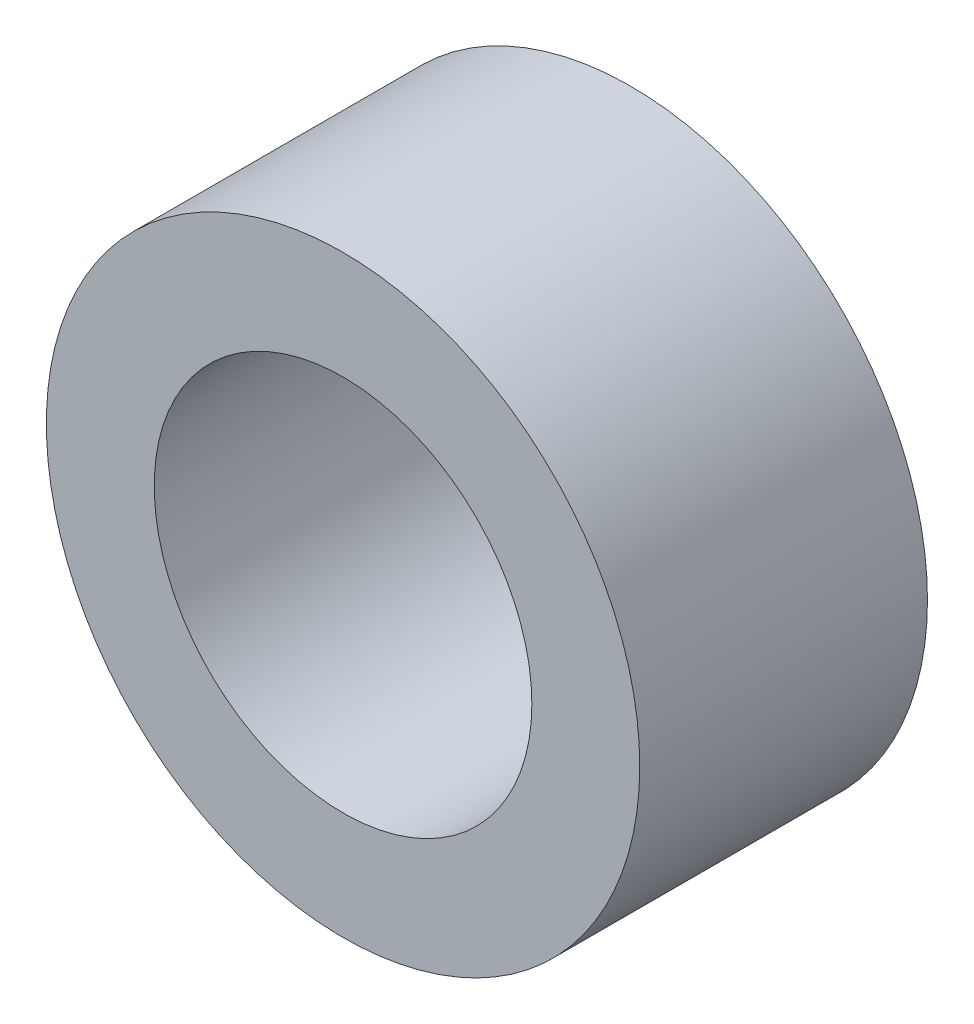
ISO-10303-21;
HEADER;
FILE_DESCRIPTION(('STEP AP214'),'2;1');
FILE_NAME('part.step','',(''),(''),'','','');
FILE_SCHEMA(('AUTOMOTIVE_DESIGN { 1 0 10303 214 1 1 1 1 }'));
ENDSEC;
DATA;
#1=APPLICATION_CONTEXT('core data for automotive mechanical design processes');
#2=APPLICATION_PROTOCOL_DEFINITION('international standard','automotive_design',2000,#1);
#3=PRODUCT_CONTEXT('',#1,'mechanical');
#4=PRODUCT('Part','Part','',(#3));
#5=PRODUCT_RELATED_PRODUCT_CATEGORY('part','',(#4));
#6=PRODUCT_DEFINITION_FORMATION('','',#4);
#7=PRODUCT_DEFINITION_CONTEXT('part definition',#1,'design');
#8=PRODUCT_DEFINITION('design','',#6,#7);
#9=PRODUCT_DEFINITION_SHAPE('','',#8);
#10=(LENGTH_UNIT() NAMED_UNIT(*) SI_UNIT(.MILLI.,.METRE.));
#11=(NAMED_UNIT(*) PLANE_ANGLE_UNIT() SI_UNIT($,.RADIAN.));
#12=(NAMED_UNIT(*) SI_UNIT($,.STERADIAN.) SOLID_ANGLE_UNIT());
#13=UNCERTAINTY_MEASURE_WITH_UNIT(LENGTH_MEASURE(1.E-05),#10,'distance_accuracy_value','');
#14=(GEOMETRIC_REPRESENTATION_CONTEXT(3) GLOBAL_UNCERTAINTY_ASSIGNED_CONTEXT((#13)) GLOBAL_UNIT_ASSIGNED_CONTEXT((#10,
#11,#12)) REPRESENTATION_CONTEXT('',''));
#15=CARTESIAN_POINT('',(0.,0.,0.));
#16=DIRECTION('',(0.,0.,1.));
#17=DIRECTION('',(1.,0.,0.));
#18=AXIS2_PLACEMENT_3D('',#15,#16,#17);
#19=CARTESIAN_POINT('',(0.,0.,8.));
#20=DIRECTION('',(0.,0.,1.));
#21=DIRECTION('',(1.,0.,0.));
#22=AXIS2_PLACEMENT_3D('',#19,#20,#21);
#23=PLANE('',#22);
#24=CARTESIAN_POINT('',(0.,0.,8.));
#25=DIRECTION('',(0.,0.,1.));
#26=DIRECTION('',(1.,0.,0.));
#27=AXIS2_PLACEMENT_3D('',#24,#25,#26);
#28=CIRCLE('',#27,8.25);
#29=CARTESIAN_POINT('',(8.25,0.,8.));
#30=VERTEX_POINT('',#29);
#31=EDGE_CURVE('E10',#30,#30,#28,.T.);
#32=ORIENTED_EDGE('',*,*,#31,.T.);
#33=EDGE_LOOP('',(#32));
#34=FACE_BOUND('',#33,.T.);
#35=CARTESIAN_POINT('',(0.,0.,8.));
#36=DIRECTION('',(0.,0.,1.));
#37=DIRECTION('',(1.,0.,0.));
#38=AXIS2_PLACEMENT_3D('',#35,#36,#37);
#39=CIRCLE('',#38,5.25);
#40=CARTESIAN_POINT('',(5.25,0.,8.));
#41=VERTEX_POINT('',#40);
#42=EDGE_CURVE('E50',#41,#41,#39,.T.);
#43=ORIENTED_EDGE('',*,*,#42,.F.);
#44=EDGE_LOOP('',(#43));
#45=FACE_BOUND('',#44,.T.);
#46=ADVANCED_FACE('F37',(#34,#45),#23,.T.);
#47=CARTESIAN_POINT('',(0.,0.,0.));
#48=DIRECTION('',(0.,0.,1.));
#49=DIRECTION('',(1.,0.,0.));
#50=AXIS2_PLACEMENT_3D('',#47,#48,#49);
#51=PLANE('',#50);
#52=CARTESIAN_POINT('',(0.,0.,0.));
#53=DIRECTION('',(0.,0.,1.));
#54=DIRECTION('',(1.,0.,0.));
#55=AXIS2_PLACEMENT_3D('',#52,#53,#54);
#56=CIRCLE('',#55,8.25);
#57=CARTESIAN_POINT('',(8.25,0.,0.));
#58=VERTEX_POINT('',#57);
#59=EDGE_CURVE('E41',#58,#58,#56,.T.);
#60=ORIENTED_EDGE('',*,*,#59,.F.);
#61=EDGE_LOOP('',(#60));
#62=FACE_BOUND('',#61,.T.);
#63=CARTESIAN_POINT('',(0.,0.,0.));
#64=DIRECTION('',(0.,0.,1.));
#65=DIRECTION('',(1.,0.,0.));
#66=AXIS2_PLACEMENT_3D('',#63,#64,#65);
#67=CIRCLE('',#66,5.25);
#68=CARTESIAN_POINT('',(5.25,0.,0.));
#69=VERTEX_POINT('',#68);
#70=EDGE_CURVE('E52',#69,#69,#67,.T.);
#71=ORIENTED_EDGE('',*,*,#70,.T.);
#72=EDGE_LOOP('',(#71));
#73=FACE_BOUND('',#72,.T.);
#74=ADVANCED_FACE('F64',(#62,#73),#51,.F.);
#75=CARTESIAN_POINT('',(0.,0.,8.));
#76=DIRECTION('',(0.,0.,-1.));
#77=DIRECTION('',(-1.,0.,0.));
#78=AXIS2_PLACEMENT_3D('',#75,#76,#77);
#79=CYLINDRICAL_SURFACE('',#78,8.25);
#80=ORIENTED_EDGE('',*,*,#31,.F.);
#81=EDGE_LOOP('',(#80));
#82=FACE_BOUND('',#81,.T.);
#83=ORIENTED_EDGE('',*,*,#59,.T.);
#84=EDGE_LOOP('',(#83));
#85=FACE_BOUND('',#84,.T.);
#86=ADVANCED_FACE('F39',(#82,#85),#79,.T.);
#87=CARTESIAN_POINT('',(0.,0.,8.));
#88=DIRECTION('',(0.,0.,-1.));
#89=DIRECTION('',(-1.,0.,0.));
#90=AXIS2_PLACEMENT_3D('',#87,#88,#89);
#91=CYLINDRICAL_SURFACE('',#90,5.25);
#92=ORIENTED_EDGE('',*,*,#42,.T.);
#93=EDGE_LOOP('',(#92));
#94=FACE_BOUND('',#93,.T.);
#95=ORIENTED_EDGE('',*,*,#70,.F.);
#96=EDGE_LOOP('',(#95));
#97=FACE_BOUND('',#96,.T.);
#98=ADVANCED_FACE('F60',(#94,#97),#91,.F.);
#99=CLOSED_SHELL('',(#46,#74,#86,#98));
#100=MANIFOLD_SOLID_BREP('B2',#99);
#101=ADVANCED_BREP_SHAPE_REPRESENTATION('',(#18,#100),#14);
#102=SHAPE_DEFINITION_REPRESENTATION(#9,#101);
ENDSEC;
END-ISO-10303-21;
